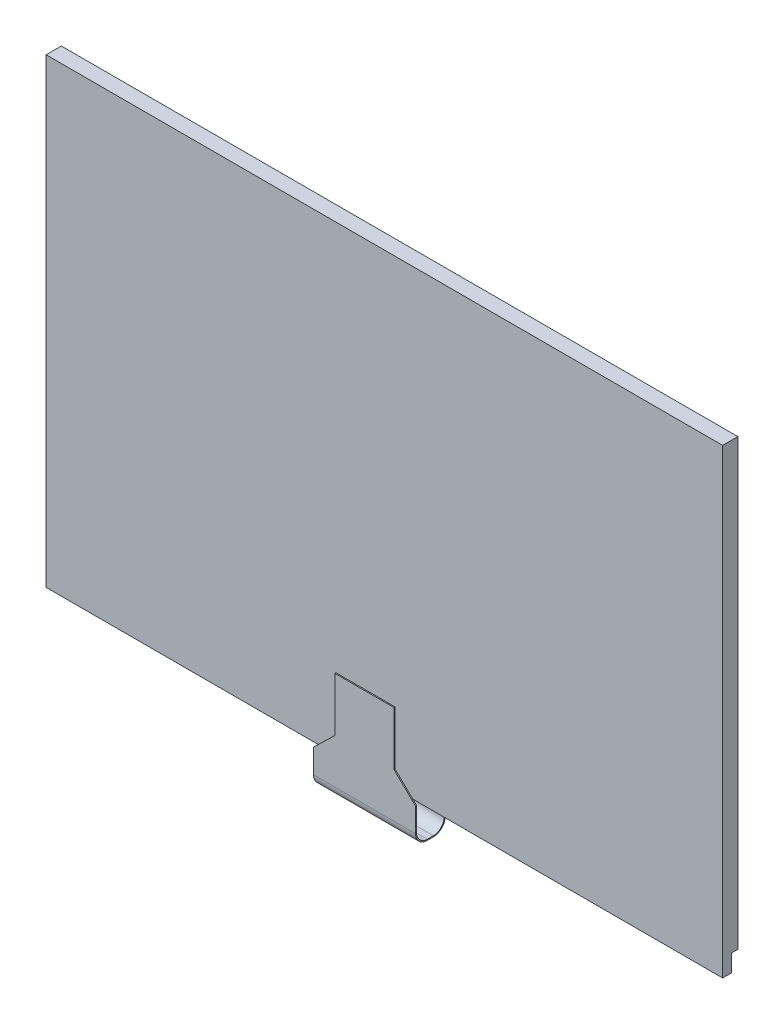
ISO-10303-21;
HEADER;
FILE_DESCRIPTION(('STEP AP214'),'2;1');
FILE_NAME('part.step','',(''),(''),'','','');
FILE_SCHEMA(('AUTOMOTIVE_DESIGN { 1 0 10303 214 1 1 1 1 }'));
ENDSEC;
DATA;
#1=APPLICATION_CONTEXT('core data for automotive mechanical design processes');
#2=APPLICATION_PROTOCOL_DEFINITION('international standard','automotive_design',2000,#1);
#3=PRODUCT_CONTEXT('',#1,'mechanical');
#4=PRODUCT('Part','Part','',(#3));
#5=PRODUCT_RELATED_PRODUCT_CATEGORY('part','',(#4));
#6=PRODUCT_DEFINITION_FORMATION('','',#4);
#7=PRODUCT_DEFINITION_CONTEXT('part definition',#1,'design');
#8=PRODUCT_DEFINITION('design','',#6,#7);
#9=PRODUCT_DEFINITION_SHAPE('','',#8);
#10=(LENGTH_UNIT() NAMED_UNIT(*) SI_UNIT(.MILLI.,.METRE.));
#11=(NAMED_UNIT(*) PLANE_ANGLE_UNIT() SI_UNIT($,.RADIAN.));
#12=(NAMED_UNIT(*) SI_UNIT($,.STERADIAN.) SOLID_ANGLE_UNIT());
#13=UNCERTAINTY_MEASURE_WITH_UNIT(LENGTH_MEASURE(1.E-05),#10,'distance_accuracy_value','');
#14=(GEOMETRIC_REPRESENTATION_CONTEXT(3) GLOBAL_UNCERTAINTY_ASSIGNED_CONTEXT((#13)) GLOBAL_UNIT_ASSIGNED_CONTEXT((#10,
#11,#12)) REPRESENTATION_CONTEXT('',''));
#15=CARTESIAN_POINT('',(0.,0.,0.));
#16=DIRECTION('',(0.,0.,1.));
#17=DIRECTION('',(1.,0.,0.));
#18=AXIS2_PLACEMENT_3D('',#15,#16,#17);
#19=CARTESIAN_POINT('',(31.4,22.31,-0.83));
#20=DIRECTION('',(0.,0.,1.));
#21=DIRECTION('',(0.,-1.,0.));
#22=AXIS2_PLACEMENT_3D('',#19,#20,#21);
#23=PLANE('',#22);
#24=DIRECTION('',(1.,0.,0.));
#25=VECTOR('',#24,1.);
#26=CARTESIAN_POINT('',(31.4,42.52,-0.83));
#27=LINE('',#26,#25);
#28=CARTESIAN_POINT('',(62.4,42.52,-0.83));
#29=VERTEX_POINT('',#28);
#30=CARTESIAN_POINT('',(0.400000000000001,42.52,-0.83));
#31=VERTEX_POINT('',#30);
#32=EDGE_CURVE('P0_E95',#29,#31,#27,.F.);
#33=ORIENTED_EDGE('',*,*,#32,.F.);
#34=DIRECTION('',(0.,1.,0.));
#35=VECTOR('',#34,1.);
#36=CARTESIAN_POINT('',(62.4,22.31,-0.83));
#37=LINE('',#36,#35);
#38=CARTESIAN_POINT('',(62.4,2.1,-0.83));
#39=VERTEX_POINT('',#38);
#40=EDGE_CURVE('P0_E92',#39,#29,#37,.T.);
#41=ORIENTED_EDGE('',*,*,#40,.F.);
#42=DIRECTION('',(1.,0.,0.));
#43=VECTOR('',#42,1.);
#44=CARTESIAN_POINT('',(31.4,2.1,-0.83));
#45=LINE('',#44,#43);
#46=CARTESIAN_POINT('',(0.400000000000001,2.1,-0.83));
#47=VERTEX_POINT('',#46);
#48=EDGE_CURVE('P0_E110',#47,#39,#45,.T.);
#49=ORIENTED_EDGE('',*,*,#48,.F.);
#50=DIRECTION('',(0.,1.,0.));
#51=VECTOR('',#50,1.);
#52=CARTESIAN_POINT('',(0.4,22.31,-0.83));
#53=LINE('',#52,#51);
#54=EDGE_CURVE('P0_E98',#31,#47,#53,.F.);
#55=ORIENTED_EDGE('',*,*,#54,.F.);
#56=EDGE_LOOP('',(#33,#41,#49,#55));
#57=FACE_BOUND('',#56,.T.);
#58=ADVANCED_FACE('P0_F17',(#57),#23,.F.);
#59=CARTESIAN_POINT('',(31.4,1.6,0.));
#60=DIRECTION('',(0.,-1.,0.));
#61=DIRECTION('',(0.,0.,-1.));
#62=AXIS2_PLACEMENT_3D('',#59,#60,#61);
#63=PLANE('',#62);
#64=DIRECTION('',(1.,0.,0.));
#65=VECTOR('',#64,1.);
#66=CARTESIAN_POINT('',(31.4,1.6,0.));
#67=LINE('',#66,#65);
#68=CARTESIAN_POINT('',(62.8,1.6,0.));
#69=VERTEX_POINT('',#68);
#70=CARTESIAN_POINT('',(0.,1.6,0.));
#71=VERTEX_POINT('',#70);
#72=EDGE_CURVE('P0_E125',#69,#71,#67,.F.);
#73=ORIENTED_EDGE('',*,*,#72,.T.);
#74=DIRECTION('',(0.,0.,-1.));
#75=VECTOR('',#74,1.);
#76=CARTESIAN_POINT('',(0.,1.6,0.));
#77=LINE('',#76,#75);
#78=CARTESIAN_POINT('',(0.,1.6,-0.6));
#79=VERTEX_POINT('',#78);
#80=EDGE_CURVE('P0_E101',#71,#79,#77,.T.);
#81=ORIENTED_EDGE('',*,*,#80,.T.);
#82=DIRECTION('',(1.,0.,0.));
#83=VECTOR('',#82,1.);
#84=CARTESIAN_POINT('',(31.4,1.6,-0.6));
#85=LINE('',#84,#83);
#86=CARTESIAN_POINT('',(62.8,1.6,-0.6));
#87=VERTEX_POINT('',#86);
#88=EDGE_CURVE('P0_E127',#79,#87,#85,.T.);
#89=ORIENTED_EDGE('',*,*,#88,.T.);
#90=DIRECTION('',(0.,0.,-1.));
#91=VECTOR('',#90,1.);
#92=CARTESIAN_POINT('',(62.8,1.6,0.));
#93=LINE('',#92,#91);
#94=EDGE_CURVE('P0_E20',#87,#69,#93,.F.);
#95=ORIENTED_EDGE('',*,*,#94,.T.);
#96=EDGE_LOOP('',(#73,#81,#89,#95));
#97=FACE_BOUND('',#96,.T.);
#98=ADVANCED_FACE('P0_F124',(#97),#63,.T.);
#99=CARTESIAN_POINT('',(31.4,42.52,-0.6));
#100=DIRECTION('',(0.,1.,0.));
#101=DIRECTION('',(0.,0.,1.));
#102=AXIS2_PLACEMENT_3D('',#99,#100,#101);
#103=PLANE('',#102);
#104=DIRECTION('',(1.,0.,0.));
#105=VECTOR('',#104,1.);
#106=CARTESIAN_POINT('',(31.4,42.52,-0.6));
#107=LINE('',#106,#105);
#108=CARTESIAN_POINT('',(0.400000000000001,42.52,-0.6));
#109=VERTEX_POINT('',#108);
#110=CARTESIAN_POINT('',(62.4,42.52,-0.6));
#111=VERTEX_POINT('',#110);
#112=EDGE_CURVE('P0_E107',#109,#111,#107,.T.);
#113=ORIENTED_EDGE('',*,*,#112,.T.);
#114=DIRECTION('',(0.,0.,-1.));
#115=VECTOR('',#114,1.);
#116=CARTESIAN_POINT('',(62.4,42.52,-0.6));
#117=LINE('',#116,#115);
#118=EDGE_CURVE('P0_E104',#29,#111,#117,.F.);
#119=ORIENTED_EDGE('',*,*,#118,.F.);
#120=ORIENTED_EDGE('',*,*,#32,.T.);
#121=DIRECTION('',(0.,0.,1.));
#122=VECTOR('',#121,1.);
#123=CARTESIAN_POINT('',(0.4,42.52,-0.6));
#124=LINE('',#123,#122);
#125=EDGE_CURVE('P0_E138',#109,#31,#124,.F.);
#126=ORIENTED_EDGE('',*,*,#125,.F.);
#127=EDGE_LOOP('',(#113,#119,#120,#126));
#128=FACE_BOUND('',#127,.T.);
#129=ADVANCED_FACE('P0_F105',(#128),#103,.T.);
#130=CARTESIAN_POINT('',(62.4,22.31,-0.6));
#131=DIRECTION('',(1.,0.,0.));
#132=DIRECTION('',(0.,0.,-1.));
#133=AXIS2_PLACEMENT_3D('',#130,#131,#132);
#134=PLANE('',#133);
#135=DIRECTION('',(0.,1.,0.));
#136=VECTOR('',#135,1.);
#137=CARTESIAN_POINT('',(62.4,22.21,-0.6));
#138=LINE('',#137,#136);
#139=CARTESIAN_POINT('',(62.4,2.1,-0.6));
#140=VERTEX_POINT('',#139);
#141=EDGE_CURVE('P0_E162',#111,#140,#138,.F.);
#142=ORIENTED_EDGE('',*,*,#141,.T.);
#143=DIRECTION('',(0.,0.,-1.));
#144=VECTOR('',#143,1.);
#145=CARTESIAN_POINT('',(62.4,2.1,-0.6));
#146=LINE('',#145,#144);
#147=EDGE_CURVE('P0_E114',#39,#140,#146,.F.);
#148=ORIENTED_EDGE('',*,*,#147,.F.);
#149=ORIENTED_EDGE('',*,*,#40,.T.);
#150=ORIENTED_EDGE('',*,*,#118,.T.);
#151=EDGE_LOOP('',(#142,#148,#149,#150));
#152=FACE_BOUND('',#151,.T.);
#153=ADVANCED_FACE('P0_F112',(#152),#134,.T.);
#154=CARTESIAN_POINT('',(31.4,2.1,-0.6));
#155=DIRECTION('',(0.,-1.,0.));
#156=DIRECTION('',(0.,0.,-1.));
#157=AXIS2_PLACEMENT_3D('',#154,#155,#156);
#158=PLANE('',#157);
#159=DIRECTION('',(1.,0.,0.));
#160=VECTOR('',#159,1.);
#161=CARTESIAN_POINT('',(31.4,2.1,-0.6));
#162=LINE('',#161,#160);
#163=CARTESIAN_POINT('',(0.400000000000001,2.1,-0.6));
#164=VERTEX_POINT('',#163);
#165=EDGE_CURVE('P0_E151',#140,#164,#162,.F.);
#166=ORIENTED_EDGE('',*,*,#165,.T.);
#167=DIRECTION('',(0.,0.,1.));
#168=VECTOR('',#167,1.);
#169=CARTESIAN_POINT('',(0.4,2.1,-0.6));
#170=LINE('',#169,#168);
#171=EDGE_CURVE('P0_E143',#47,#164,#170,.T.);
#172=ORIENTED_EDGE('',*,*,#171,.F.);
#173=ORIENTED_EDGE('',*,*,#48,.T.);
#174=ORIENTED_EDGE('',*,*,#147,.T.);
#175=EDGE_LOOP('',(#166,#172,#173,#174));
#176=FACE_BOUND('',#175,.T.);
#177=ADVANCED_FACE('P0_F149',(#176),#158,.T.);
#178=CARTESIAN_POINT('',(0.4,22.31,-0.6));
#179=DIRECTION('',(-1.,0.,0.));
#180=DIRECTION('',(0.,0.,1.));
#181=AXIS2_PLACEMENT_3D('',#178,#179,#180);
#182=PLANE('',#181);
#183=DIRECTION('',(0.,1.,0.));
#184=VECTOR('',#183,1.);
#185=CARTESIAN_POINT('',(0.400000000000001,22.21,-0.6));
#186=LINE('',#185,#184);
#187=EDGE_CURVE('P0_E156',#164,#109,#186,.T.);
#188=ORIENTED_EDGE('',*,*,#187,.T.);
#189=ORIENTED_EDGE('',*,*,#125,.T.);
#190=ORIENTED_EDGE('',*,*,#54,.T.);
#191=ORIENTED_EDGE('',*,*,#171,.T.);
#192=EDGE_LOOP('',(#188,#189,#190,#191));
#193=FACE_BOUND('',#192,.T.);
#194=ADVANCED_FACE('P0_F155',(#193),#182,.T.);
#195=CARTESIAN_POINT('',(31.4,21.41,0.));
#196=DIRECTION('',(0.,0.,1.));
#197=DIRECTION('',(1.,0.,0.));
#198=AXIS2_PLACEMENT_3D('',#195,#196,#197);
#199=PLANE('',#198);
#200=DIRECTION('',(0.,1.,0.));
#201=VECTOR('',#200,1.);
#202=CARTESIAN_POINT('',(62.8,21.41,0.));
#203=LINE('',#202,#201);
#204=CARTESIAN_POINT('',(62.8,0.,0.));
#205=VERTEX_POINT('',#204);
#206=EDGE_CURVE('P0_E134',#205,#69,#203,.T.);
#207=ORIENTED_EDGE('',*,*,#206,.F.);
#208=DIRECTION('',(1.,0.,0.));
#209=VECTOR('',#208,1.);
#210=CARTESIAN_POINT('',(31.4,0.,0.));
#211=LINE('',#210,#209);
#212=CARTESIAN_POINT('',(0.,0.,0.));
#213=VERTEX_POINT('',#212);
#214=EDGE_CURVE('P0_E177',#213,#205,#211,.T.);
#215=ORIENTED_EDGE('',*,*,#214,.F.);
#216=DIRECTION('',(0.,-1.,0.));
#217=VECTOR('',#216,1.);
#218=CARTESIAN_POINT('',(0.,21.41,0.));
#219=LINE('',#218,#217);
#220=EDGE_CURVE('P0_E135',#71,#213,#219,.T.);
#221=ORIENTED_EDGE('',*,*,#220,.F.);
#222=ORIENTED_EDGE('',*,*,#72,.F.);
#223=EDGE_LOOP('',(#207,#215,#221,#222));
#224=FACE_BOUND('',#223,.T.);
#225=ADVANCED_FACE('P0_F132',(#224),#199,.F.);
#226=CARTESIAN_POINT('',(31.4,22.21,-0.6));
#227=DIRECTION('',(0.,0.,1.));
#228=DIRECTION('',(1.,0.,0.));
#229=AXIS2_PLACEMENT_3D('',#226,#227,#228);
#230=PLANE('',#229);
#231=ORIENTED_EDGE('',*,*,#165,.F.);
#232=ORIENTED_EDGE('',*,*,#141,.F.);
#233=ORIENTED_EDGE('',*,*,#112,.F.);
#234=ORIENTED_EDGE('',*,*,#187,.F.);
#235=EDGE_LOOP('',(#231,#232,#233,#234));
#236=FACE_BOUND('',#235,.T.);
#237=DIRECTION('',(0.,-1.,0.));
#238=VECTOR('',#237,1.);
#239=CARTESIAN_POINT('',(0.,21.41,-0.6));
#240=LINE('',#239,#238);
#241=CARTESIAN_POINT('',(0.,42.82,-0.6));
#242=VERTEX_POINT('',#241);
#243=EDGE_CURVE('P0_E170',#242,#79,#240,.T.);
#244=ORIENTED_EDGE('',*,*,#243,.F.);
#245=DIRECTION('',(1.,0.,0.));
#246=VECTOR('',#245,1.);
#247=CARTESIAN_POINT('',(31.4,42.82,-0.6));
#248=LINE('',#247,#246);
#249=CARTESIAN_POINT('',(62.8,42.82,-0.6));
#250=VERTEX_POINT('',#249);
#251=EDGE_CURVE('P0_E158',#250,#242,#248,.F.);
#252=ORIENTED_EDGE('',*,*,#251,.F.);
#253=DIRECTION('',(0.,1.,0.));
#254=VECTOR('',#253,1.);
#255=CARTESIAN_POINT('',(62.8,21.41,-0.6));
#256=LINE('',#255,#254);
#257=EDGE_CURVE('P0_E180',#87,#250,#256,.T.);
#258=ORIENTED_EDGE('',*,*,#257,.F.);
#259=ORIENTED_EDGE('',*,*,#88,.F.);
#260=EDGE_LOOP('',(#244,#252,#258,#259));
#261=FACE_BOUND('',#260,.T.);
#262=ADVANCED_FACE('P0_F160',(#236,#261),#230,.F.);
#263=CARTESIAN_POINT('',(31.4,42.82,0.));
#264=DIRECTION('',(0.,1.,0.));
#265=DIRECTION('',(0.,0.,1.));
#266=AXIS2_PLACEMENT_3D('',#263,#264,#265);
#267=PLANE('',#266);
#268=ORIENTED_EDGE('',*,*,#251,.T.);
#269=DIRECTION('',(0.,0.,1.));
#270=VECTOR('',#269,1.);
#271=CARTESIAN_POINT('',(0.,42.82,0.));
#272=LINE('',#271,#270);
#273=CARTESIAN_POINT('',(0.,42.82,0.81));
#274=VERTEX_POINT('',#273);
#275=EDGE_CURVE('P0_E167',#274,#242,#272,.F.);
#276=ORIENTED_EDGE('',*,*,#275,.F.);
#277=DIRECTION('',(1.,0.,0.));
#278=VECTOR('',#277,1.);
#279=CARTESIAN_POINT('',(31.4,42.82,0.81));
#280=LINE('',#279,#278);
#281=CARTESIAN_POINT('',(62.8,42.82,0.81));
#282=VERTEX_POINT('',#281);
#283=EDGE_CURVE('P0_E185',#282,#274,#280,.F.);
#284=ORIENTED_EDGE('',*,*,#283,.F.);
#285=DIRECTION('',(0.,0.,-1.));
#286=VECTOR('',#285,1.);
#287=CARTESIAN_POINT('',(62.8,42.82,0.));
#288=LINE('',#287,#286);
#289=EDGE_CURVE('P0_E182',#250,#282,#288,.F.);
#290=ORIENTED_EDGE('',*,*,#289,.F.);
#291=EDGE_LOOP('',(#268,#276,#284,#290));
#292=FACE_BOUND('',#291,.T.);
#293=ADVANCED_FACE('P0_F202',(#292),#267,.T.);
#294=CARTESIAN_POINT('',(0.,21.41,0.));
#295=DIRECTION('',(-1.,0.,0.));
#296=DIRECTION('',(0.,-1.,0.));
#297=AXIS2_PLACEMENT_3D('',#294,#295,#296);
#298=PLANE('',#297);
#299=ORIENTED_EDGE('',*,*,#220,.T.);
#300=DIRECTION('',(0.,0.,-1.));
#301=VECTOR('',#300,1.);
#302=CARTESIAN_POINT('',(0.,0.,0.));
#303=LINE('',#302,#301);
#304=CARTESIAN_POINT('',(0.,0.,0.81));
#305=VERTEX_POINT('',#304);
#306=EDGE_CURVE('P0_E174',#305,#213,#303,.T.);
#307=ORIENTED_EDGE('',*,*,#306,.F.);
#308=DIRECTION('',(0.,1.,0.));
#309=VECTOR('',#308,1.);
#310=CARTESIAN_POINT('',(0.,21.41,0.81));
#311=LINE('',#310,#309);
#312=EDGE_CURVE('P0_E188',#274,#305,#311,.F.);
#313=ORIENTED_EDGE('',*,*,#312,.F.);
#314=ORIENTED_EDGE('',*,*,#275,.T.);
#315=ORIENTED_EDGE('',*,*,#243,.T.);
#316=ORIENTED_EDGE('',*,*,#80,.F.);
#317=EDGE_LOOP('',(#299,#307,#313,#314,#315,#316));
#318=FACE_BOUND('',#317,.T.);
#319=ADVANCED_FACE('P0_F197',(#318),#298,.T.);
#320=CARTESIAN_POINT('',(31.4,0.,0.));
#321=DIRECTION('',(0.,-1.,0.));
#322=DIRECTION('',(0.,0.,-1.));
#323=AXIS2_PLACEMENT_3D('',#320,#321,#322);
#324=PLANE('',#323);
#325=ORIENTED_EDGE('',*,*,#214,.T.);
#326=DIRECTION('',(0.,0.,-1.));
#327=VECTOR('',#326,1.);
#328=CARTESIAN_POINT('',(62.8,0.,0.));
#329=LINE('',#328,#327);
#330=CARTESIAN_POINT('',(62.8,0.,0.81));
#331=VERTEX_POINT('',#330);
#332=EDGE_CURVE('P0_E35',#331,#205,#329,.T.);
#333=ORIENTED_EDGE('',*,*,#332,.F.);
#334=DIRECTION('',(1.,0.,0.));
#335=VECTOR('',#334,1.);
#336=CARTESIAN_POINT('',(31.4,0.,0.81));
#337=LINE('',#336,#335);
#338=EDGE_CURVE('P0_E26',#305,#331,#337,.T.);
#339=ORIENTED_EDGE('',*,*,#338,.F.);
#340=ORIENTED_EDGE('',*,*,#306,.T.);
#341=EDGE_LOOP('',(#325,#333,#339,#340));
#342=FACE_BOUND('',#341,.T.);
#343=ADVANCED_FACE('P0_F195',(#342),#324,.T.);
#344=CARTESIAN_POINT('',(62.8,21.41,0.));
#345=DIRECTION('',(1.,0.,0.));
#346=DIRECTION('',(0.,0.,-1.));
#347=AXIS2_PLACEMENT_3D('',#344,#345,#346);
#348=PLANE('',#347);
#349=ORIENTED_EDGE('',*,*,#257,.T.);
#350=ORIENTED_EDGE('',*,*,#289,.T.);
#351=DIRECTION('',(0.,1.,0.));
#352=VECTOR('',#351,1.);
#353=CARTESIAN_POINT('',(62.8,21.41,0.81));
#354=LINE('',#353,#352);
#355=EDGE_CURVE('P0_E11',#331,#282,#354,.T.);
#356=ORIENTED_EDGE('',*,*,#355,.F.);
#357=ORIENTED_EDGE('',*,*,#332,.T.);
#358=ORIENTED_EDGE('',*,*,#206,.T.);
#359=ORIENTED_EDGE('',*,*,#94,.F.);
#360=EDGE_LOOP('',(#349,#350,#356,#357,#358,#359));
#361=FACE_BOUND('',#360,.T.);
#362=ADVANCED_FACE('P0_F200',(#361),#348,.T.);
#363=CARTESIAN_POINT('',(31.4,21.41,0.81));
#364=DIRECTION('',(0.,0.,1.));
#365=DIRECTION('',(1.,0.,0.));
#366=AXIS2_PLACEMENT_3D('',#363,#364,#365);
#367=PLANE('',#366);
#368=ORIENTED_EDGE('',*,*,#338,.T.);
#369=ORIENTED_EDGE('',*,*,#355,.T.);
#370=ORIENTED_EDGE('',*,*,#283,.T.);
#371=ORIENTED_EDGE('',*,*,#312,.T.);
#372=EDGE_LOOP('',(#368,#369,#370,#371));
#373=FACE_BOUND('',#372,.T.);
#374=ADVANCED_FACE('P0_F193',(#373),#367,.T.);
#375=CLOSED_SHELL('',(#58,#98,#129,#153,#177,#194,#225,#262,#293,#319,#343,#362,#374));
#376=MANIFOLD_SOLID_BREP('P0_B1',#375);
#377=CARTESIAN_POINT('',(31.4,23.18,-0.835));
#378=DIRECTION('',(0.,0.,1.));
#379=DIRECTION('',(1.,0.,0.));
#380=AXIS2_PLACEMENT_3D('',#377,#378,#379);
#381=PLANE('',#380);
#382=DIRECTION('',(-1.,0.,0.));
#383=VECTOR('',#382,1.);
#384=CARTESIAN_POINT('',(31.4,40.82,-0.835));
#385=LINE('',#384,#383);
#386=CARTESIAN_POINT('',(60.8,40.82,-0.835));
#387=VERTEX_POINT('',#386);
#388=CARTESIAN_POINT('',(2.,40.82,-0.835));
#389=VERTEX_POINT('',#388);
#390=EDGE_CURVE('P1_E20',#387,#389,#385,.T.);
#391=ORIENTED_EDGE('',*,*,#390,.F.);
#392=DIRECTION('',(0.,1.,0.));
#393=VECTOR('',#392,1.);
#394=CARTESIAN_POINT('',(60.8,23.18,-0.835));
#395=LINE('',#394,#393);
#396=CARTESIAN_POINT('',(60.8,5.54,-0.835));
#397=VERTEX_POINT('',#396);
#398=EDGE_CURVE('P1_E80',#397,#387,#395,.T.);
#399=ORIENTED_EDGE('',*,*,#398,.F.);
#400=DIRECTION('',(1.,0.,0.));
#401=VECTOR('',#400,1.);
#402=CARTESIAN_POINT('',(31.4,5.54,-0.835));
#403=LINE('',#402,#401);
#404=CARTESIAN_POINT('',(2.,5.54,-0.835));
#405=VERTEX_POINT('',#404);
#406=EDGE_CURVE('P1_E68',#405,#397,#403,.T.);
#407=ORIENTED_EDGE('',*,*,#406,.F.);
#408=DIRECTION('',(0.,-1.,0.));
#409=VECTOR('',#408,1.);
#410=CARTESIAN_POINT('',(2.,23.18,-0.835));
#411=LINE('',#410,#409);
#412=EDGE_CURVE('P1_E55',#389,#405,#411,.T.);
#413=ORIENTED_EDGE('',*,*,#412,.F.);
#414=EDGE_LOOP('',(#391,#399,#407,#413));
#415=FACE_BOUND('',#414,.T.);
#416=ADVANCED_FACE('P1_F17',(#415),#381,.F.);
#417=CARTESIAN_POINT('',(31.4,40.82,-0.835));
#418=DIRECTION('',(0.,1.,0.));
#419=DIRECTION('',(-1.,0.,0.));
#420=AXIS2_PLACEMENT_3D('',#417,#418,#419);
#421=PLANE('',#420);
#422=ORIENTED_EDGE('',*,*,#390,.T.);
#423=DIRECTION('',(0.,0.,1.));
#424=VECTOR('',#423,1.);
#425=CARTESIAN_POINT('',(2.,40.82,-0.835));
#426=LINE('',#425,#424);
#427=CARTESIAN_POINT('',(2.,40.82,-0.83));
#428=VERTEX_POINT('',#427);
#429=EDGE_CURVE('P1_E61',#428,#389,#426,.F.);
#430=ORIENTED_EDGE('',*,*,#429,.F.);
#431=DIRECTION('',(1.,0.,0.));
#432=VECTOR('',#431,1.);
#433=CARTESIAN_POINT('',(31.4,40.82,-0.83));
#434=LINE('',#433,#432);
#435=CARTESIAN_POINT('',(60.8,40.82,-0.83));
#436=VERTEX_POINT('',#435);
#437=EDGE_CURVE('P1_E83',#436,#428,#434,.F.);
#438=ORIENTED_EDGE('',*,*,#437,.F.);
#439=DIRECTION('',(0.,0.,-1.));
#440=VECTOR('',#439,1.);
#441=CARTESIAN_POINT('',(60.8,40.82,-0.835));
#442=LINE('',#441,#440);
#443=EDGE_CURVE('P1_E64',#387,#436,#442,.F.);
#444=ORIENTED_EDGE('',*,*,#443,.F.);
#445=EDGE_LOOP('',(#422,#430,#438,#444));
#446=FACE_BOUND('',#445,.T.);
#447=ADVANCED_FACE('P1_F60',(#446),#421,.T.);
#448=CARTESIAN_POINT('',(2.,23.18,-0.835));
#449=DIRECTION('',(-1.,0.,0.));
#450=DIRECTION('',(0.,-1.,0.));
#451=AXIS2_PLACEMENT_3D('',#448,#449,#450);
#452=PLANE('',#451);
#453=ORIENTED_EDGE('',*,*,#412,.T.);
#454=DIRECTION('',(0.,0.,-1.));
#455=VECTOR('',#454,1.);
#456=CARTESIAN_POINT('',(2.,5.54,-0.835));
#457=LINE('',#456,#455);
#458=CARTESIAN_POINT('',(2.,5.54,-0.83));
#459=VERTEX_POINT('',#458);
#460=EDGE_CURVE('P1_E70',#459,#405,#457,.T.);
#461=ORIENTED_EDGE('',*,*,#460,.F.);
#462=DIRECTION('',(0.,1.,0.));
#463=VECTOR('',#462,1.);
#464=CARTESIAN_POINT('',(2.,23.18,-0.83));
#465=LINE('',#464,#463);
#466=EDGE_CURVE('P1_E74',#428,#459,#465,.F.);
#467=ORIENTED_EDGE('',*,*,#466,.F.);
#468=ORIENTED_EDGE('',*,*,#429,.T.);
#469=EDGE_LOOP('',(#453,#461,#467,#468));
#470=FACE_BOUND('',#469,.T.);
#471=ADVANCED_FACE('P1_F72',(#470),#452,.T.);
#472=CARTESIAN_POINT('',(31.4,5.54,-0.835));
#473=DIRECTION('',(0.,-1.,0.));
#474=DIRECTION('',(0.,0.,-1.));
#475=AXIS2_PLACEMENT_3D('',#472,#473,#474);
#476=PLANE('',#475);
#477=ORIENTED_EDGE('',*,*,#406,.T.);
#478=DIRECTION('',(0.,0.,-1.));
#479=VECTOR('',#478,1.);
#480=CARTESIAN_POINT('',(60.8,5.54,-0.835));
#481=LINE('',#480,#479);
#482=CARTESIAN_POINT('',(60.8,5.54,-0.83));
#483=VERTEX_POINT('',#482);
#484=EDGE_CURVE('P1_E35',#483,#397,#481,.T.);
#485=ORIENTED_EDGE('',*,*,#484,.F.);
#486=DIRECTION('',(1.,0.,0.));
#487=VECTOR('',#486,1.);
#488=CARTESIAN_POINT('',(31.4,5.54,-0.83));
#489=LINE('',#488,#487);
#490=EDGE_CURVE('P1_E26',#459,#483,#489,.T.);
#491=ORIENTED_EDGE('',*,*,#490,.F.);
#492=ORIENTED_EDGE('',*,*,#460,.T.);
#493=EDGE_LOOP('',(#477,#485,#491,#492));
#494=FACE_BOUND('',#493,.T.);
#495=ADVANCED_FACE('P1_F89',(#494),#476,.T.);
#496=CARTESIAN_POINT('',(60.8,23.18,-0.835));
#497=DIRECTION('',(1.,0.,0.));
#498=DIRECTION('',(0.,0.,-1.));
#499=AXIS2_PLACEMENT_3D('',#496,#497,#498);
#500=PLANE('',#499);
#501=ORIENTED_EDGE('',*,*,#398,.T.);
#502=ORIENTED_EDGE('',*,*,#443,.T.);
#503=DIRECTION('',(0.,1.,0.));
#504=VECTOR('',#503,1.);
#505=CARTESIAN_POINT('',(60.8,23.18,-0.83));
#506=LINE('',#505,#504);
#507=EDGE_CURVE('P1_E11',#483,#436,#506,.T.);
#508=ORIENTED_EDGE('',*,*,#507,.F.);
#509=ORIENTED_EDGE('',*,*,#484,.T.);
#510=EDGE_LOOP('',(#501,#502,#508,#509));
#511=FACE_BOUND('',#510,.T.);
#512=ADVANCED_FACE('P1_F91',(#511),#500,.T.);
#513=CARTESIAN_POINT('',(31.4,23.18,-0.83));
#514=DIRECTION('',(0.,0.,1.));
#515=DIRECTION('',(1.,0.,0.));
#516=AXIS2_PLACEMENT_3D('',#513,#514,#515);
#517=PLANE('',#516);
#518=ORIENTED_EDGE('',*,*,#490,.T.);
#519=ORIENTED_EDGE('',*,*,#507,.T.);
#520=ORIENTED_EDGE('',*,*,#437,.T.);
#521=ORIENTED_EDGE('',*,*,#466,.T.);
#522=EDGE_LOOP('',(#518,#519,#520,#521));
#523=FACE_BOUND('',#522,.T.);
#524=ADVANCED_FACE('P1_F88',(#523),#517,.T.);
#525=CLOSED_SHELL('',(#416,#447,#471,#495,#512,#524));
#526=MANIFOLD_SOLID_BREP('P1_B1',#525);
#527=CARTESIAN_POINT('',(31.4,-6.089518552174,-0.1));
#528=DIRECTION('',(0.,0.,-1.));
#529=DIRECTION('',(-1.,0.,0.));
#530=AXIS2_PLACEMENT_3D('',#527,#528,#529);
#531=PLANE('',#530);
#532=DIRECTION('',(1.,0.,0.));
#533=VECTOR('',#532,1.);
#534=CARTESIAN_POINT('',(26.665,1.,-0.1));
#535=LINE('',#534,#533);
#536=CARTESIAN_POINT('',(36.135,1.,-0.1));
#537=VERTEX_POINT('',#536);
#538=CARTESIAN_POINT('',(26.665,1.,-0.1));
#539=VERTEX_POINT('',#538);
#540=EDGE_CURVE('P2_E151',#537,#539,#535,.F.);
#541=ORIENTED_EDGE('',*,*,#540,.F.);
#542=DIRECTION('',(0.,1.,0.));
#543=VECTOR('',#542,1.);
#544=CARTESIAN_POINT('',(36.135,1.,-0.1));
#545=LINE('',#544,#543);
#546=CARTESIAN_POINT('',(36.135,-0.8,-0.1));
#547=VERTEX_POINT('',#546);
#548=EDGE_CURVE('P2_E154',#547,#537,#545,.T.);
#549=ORIENTED_EDGE('',*,*,#548,.F.);
#550=DIRECTION('',(-1.,0.,0.));
#551=VECTOR('',#550,1.);
#552=CARTESIAN_POINT('',(31.4,-0.8,-0.1));
#553=LINE('',#552,#551);
#554=CARTESIAN_POINT('',(26.665,-0.8,-0.1));
#555=VERTEX_POINT('',#554);
#556=EDGE_CURVE('P2_E160',#555,#547,#553,.F.);
#557=ORIENTED_EDGE('',*,*,#556,.F.);
#558=DIRECTION('',(0.,1.,0.));
#559=VECTOR('',#558,1.);
#560=CARTESIAN_POINT('',(26.665,-6.86,-0.1));
#561=LINE('',#560,#559);
#562=EDGE_CURVE('P2_E161',#539,#555,#561,.F.);
#563=ORIENTED_EDGE('',*,*,#562,.F.);
#564=EDGE_LOOP('',(#541,#549,#557,#563));
#565=FACE_BOUND('',#564,.T.);
#566=ADVANCED_FACE('P2_F17',(#565),#531,.T.);
#567=CARTESIAN_POINT('',(26.665,1.,0.));
#568=DIRECTION('',(0.,1.,0.));
#569=DIRECTION('',(0.,0.,1.));
#570=AXIS2_PLACEMENT_3D('',#567,#568,#569);
#571=PLANE('',#570);
#572=ORIENTED_EDGE('',*,*,#540,.T.);
#573=DIRECTION('',(0.,0.,1.));
#574=VECTOR('',#573,1.);
#575=CARTESIAN_POINT('',(26.665,1.,0.));
#576=LINE('',#575,#574);
#577=CARTESIAN_POINT('',(26.665,1.,0.));
#578=VERTEX_POINT('',#577);
#579=EDGE_CURVE('P2_E183',#578,#539,#576,.F.);
#580=ORIENTED_EDGE('',*,*,#579,.F.);
#581=DIRECTION('',(-1.,0.,0.));
#582=VECTOR('',#581,1.);
#583=CARTESIAN_POINT('',(31.4,1.,0.));
#584=LINE('',#583,#582);
#585=CARTESIAN_POINT('',(36.135,1.,0.));
#586=VERTEX_POINT('',#585);
#587=EDGE_CURVE('P2_E164',#578,#586,#584,.F.);
#588=ORIENTED_EDGE('',*,*,#587,.T.);
#589=DIRECTION('',(0.,0.,-1.));
#590=VECTOR('',#589,1.);
#591=CARTESIAN_POINT('',(36.135,1.,0.));
#592=LINE('',#591,#590);
#593=EDGE_CURVE('P2_E181',#537,#586,#592,.F.);
#594=ORIENTED_EDGE('',*,*,#593,.F.);
#595=EDGE_LOOP('',(#572,#580,#588,#594));
#596=FACE_BOUND('',#595,.T.);
#597=ADVANCED_FACE('P2_F433',(#596),#571,.T.);
#598=CARTESIAN_POINT('',(31.4,-0.8,1.));
#599=DIRECTION('',(-1.,0.,0.));
#600=DIRECTION('',(0.,0.,1.));
#601=AXIS2_PLACEMENT_3D('',#598,#599,#600);
#602=CYLINDRICAL_SURFACE('',#601,1.1);
#603=ORIENTED_EDGE('',*,*,#556,.T.);
#604=CARTESIAN_POINT('',(36.135,-0.8,1.));
#605=DIRECTION('',(-1.,0.,0.));
#606=DIRECTION('',(0.,0.,1.));
#607=AXIS2_PLACEMENT_3D('',#604,#605,#606);
#608=CIRCLE('',#607,1.1);
#609=CARTESIAN_POINT('',(36.135,-1.9,1.));
#610=VERTEX_POINT('',#609);
#611=EDGE_CURVE('P2_E162',#547,#610,#608,.T.);
#612=ORIENTED_EDGE('',*,*,#611,.T.);
#613=DIRECTION('',(1.,0.,0.));
#614=VECTOR('',#613,1.);
#615=CARTESIAN_POINT('',(31.4,-1.9,1.));
#616=LINE('',#615,#614);
#617=CARTESIAN_POINT('',(26.665,-1.9,1.));
#618=VERTEX_POINT('',#617);
#619=EDGE_CURVE('P2_E166',#618,#610,#616,.T.);
#620=ORIENTED_EDGE('',*,*,#619,.F.);
#621=CARTESIAN_POINT('',(26.665,-0.8,1.));
#622=DIRECTION('',(-1.,0.,0.));
#623=DIRECTION('',(0.,0.,1.));
#624=AXIS2_PLACEMENT_3D('',#621,#622,#623);
#625=CIRCLE('',#624,1.1);
#626=EDGE_CURVE('P2_E157',#618,#555,#625,.F.);
#627=ORIENTED_EDGE('',*,*,#626,.T.);
#628=EDGE_LOOP('',(#603,#612,#620,#627));
#629=FACE_BOUND('',#628,.T.);
#630=ADVANCED_FACE('P2_F423',(#629),#602,.T.);
#631=CARTESIAN_POINT('',(31.4,-6.089518552174,0.));
#632=DIRECTION('',(0.,0.,-1.));
#633=DIRECTION('',(-1.,0.,0.));
#634=AXIS2_PLACEMENT_3D('',#631,#632,#633);
#635=PLANE('',#634);
#636=DIRECTION('',(-1.,0.,0.));
#637=VECTOR('',#636,1.);
#638=CARTESIAN_POINT('',(31.4,-0.8,0.));
#639=LINE('',#638,#637);
#640=CARTESIAN_POINT('',(26.665,-0.8,0.));
#641=VERTEX_POINT('',#640);
#642=CARTESIAN_POINT('',(36.135,-0.8,0.));
#643=VERTEX_POINT('',#642);
#644=EDGE_CURVE('P2_E149',#641,#643,#639,.F.);
#645=ORIENTED_EDGE('',*,*,#644,.T.);
#646=DIRECTION('',(0.,1.,0.));
#647=VECTOR('',#646,1.);
#648=CARTESIAN_POINT('',(36.135,-6.089518552174,0.));
#649=LINE('',#648,#647);
#650=EDGE_CURVE('P2_E177',#586,#643,#649,.F.);
#651=ORIENTED_EDGE('',*,*,#650,.F.);
#652=ORIENTED_EDGE('',*,*,#587,.F.);
#653=DIRECTION('',(0.,1.,0.));
#654=VECTOR('',#653,1.);
#655=CARTESIAN_POINT('',(26.665,-6.089518552174,0.));
#656=LINE('',#655,#654);
#657=EDGE_CURVE('P2_E167',#641,#578,#656,.T.);
#658=ORIENTED_EDGE('',*,*,#657,.F.);
#659=EDGE_LOOP('',(#645,#651,#652,#658));
#660=FACE_BOUND('',#659,.T.);
#661=ADVANCED_FACE('P2_F413',(#660),#635,.F.);
#662=CARTESIAN_POINT('',(31.4,-1.9,4.649607187));
#663=DIRECTION('',(0.,-1.,0.));
#664=DIRECTION('',(0.,0.,-1.));
#665=AXIS2_PLACEMENT_3D('',#662,#663,#664);
#666=PLANE('',#665);
#667=DIRECTION('',(-1.,0.,0.));
#668=VECTOR('',#667,1.);
#669=CARTESIAN_POINT('',(31.4,-1.9,1.560088634826));
#670=LINE('',#669,#668);
#671=CARTESIAN_POINT('',(26.665,-1.9,1.560088634826));
#672=VERTEX_POINT('',#671);
#673=CARTESIAN_POINT('',(36.135,-1.9,1.560088634826));
#674=VERTEX_POINT('',#673);
#675=EDGE_CURVE('P2_E174',#672,#674,#670,.F.);
#676=ORIENTED_EDGE('',*,*,#675,.F.);
#677=DIRECTION('',(0.,0.,1.));
#678=VECTOR('',#677,1.);
#679=CARTESIAN_POINT('',(26.665,-1.9,5.420088634826));
#680=LINE('',#679,#678);
#681=EDGE_CURVE('P2_E170',#618,#672,#680,.T.);
#682=ORIENTED_EDGE('',*,*,#681,.F.);
#683=ORIENTED_EDGE('',*,*,#619,.T.);
#684=DIRECTION('',(0.,0.,-1.));
#685=VECTOR('',#684,1.);
#686=CARTESIAN_POINT('',(36.135,-1.9,-2.439911365174));
#687=LINE('',#686,#685);
#688=EDGE_CURVE('P2_E175',#674,#610,#687,.T.);
#689=ORIENTED_EDGE('',*,*,#688,.F.);
#690=EDGE_LOOP('',(#676,#682,#683,#689));
#691=FACE_BOUND('',#690,.T.);
#692=ADVANCED_FACE('P2_F404',(#691),#666,.T.);
#693=CARTESIAN_POINT('',(31.4,-0.8,1.));
#694=DIRECTION('',(-1.,0.,0.));
#695=DIRECTION('',(0.,0.,1.));
#696=AXIS2_PLACEMENT_3D('',#693,#694,#695);
#697=CYLINDRICAL_SURFACE('',#696,1.);
#698=DIRECTION('',(1.,0.,0.));
#699=VECTOR('',#698,1.);
#700=CARTESIAN_POINT('',(31.4,-1.8,1.));
#701=LINE('',#700,#699);
#702=CARTESIAN_POINT('',(26.665,-1.8,1.));
#703=VERTEX_POINT('',#702);
#704=CARTESIAN_POINT('',(36.135,-1.8,1.));
#705=VERTEX_POINT('',#704);
#706=EDGE_CURVE('P2_E136',#703,#705,#701,.T.);
#707=ORIENTED_EDGE('',*,*,#706,.T.);
#708=CARTESIAN_POINT('',(36.135,-0.8,1.));
#709=DIRECTION('',(-1.,0.,0.));
#710=DIRECTION('',(0.,0.,1.));
#711=AXIS2_PLACEMENT_3D('',#708,#709,#710);
#712=CIRCLE('',#711,1.);
#713=EDGE_CURVE('P2_E150',#643,#705,#712,.T.);
#714=ORIENTED_EDGE('',*,*,#713,.F.);
#715=ORIENTED_EDGE('',*,*,#644,.F.);
#716=CARTESIAN_POINT('',(26.665,-0.8,1.));
#717=DIRECTION('',(-1.,0.,0.));
#718=DIRECTION('',(0.,0.,1.));
#719=AXIS2_PLACEMENT_3D('',#716,#717,#718);
#720=CIRCLE('',#719,1.);
#721=EDGE_CURVE('P2_E20',#703,#641,#720,.F.);
#722=ORIENTED_EDGE('',*,*,#721,.F.);
#723=EDGE_LOOP('',(#707,#714,#715,#722));
#724=FACE_BOUND('',#723,.T.);
#725=ADVANCED_FACE('P2_F147',(#724),#697,.F.);
#726=CARTESIAN_POINT('',(31.4,-0.8,1.560088634826));
#727=DIRECTION('',(-1.,0.,0.));
#728=DIRECTION('',(0.,0.,1.));
#729=AXIS2_PLACEMENT_3D('',#726,#727,#728);
#730=CYLINDRICAL_SURFACE('',#729,1.1);
#731=ORIENTED_EDGE('',*,*,#675,.T.);
#732=CARTESIAN_POINT('',(36.135,-0.8,1.560088634826));
#733=DIRECTION('',(-1.,0.,0.));
#734=DIRECTION('',(0.,0.,1.));
#735=AXIS2_PLACEMENT_3D('',#732,#733,#734);
#736=CIRCLE('',#735,1.1);
#737=CARTESIAN_POINT('',(36.135,-0.8,2.660088634826));
#738=VERTEX_POINT('',#737);
#739=EDGE_CURVE('P2_E137',#674,#738,#736,.T.);
#740=ORIENTED_EDGE('',*,*,#739,.T.);
#741=DIRECTION('',(1.,0.,0.));
#742=VECTOR('',#741,1.);
#743=CARTESIAN_POINT('',(31.4,-0.8,2.660088634826));
#744=LINE('',#743,#742);
#745=CARTESIAN_POINT('',(26.665,-0.8,2.660088634826));
#746=VERTEX_POINT('',#745);
#747=EDGE_CURVE('P2_E216',#746,#738,#744,.T.);
#748=ORIENTED_EDGE('',*,*,#747,.F.);
#749=CARTESIAN_POINT('',(26.665,-0.8,1.560088634826));
#750=DIRECTION('',(-1.,0.,0.));
#751=DIRECTION('',(0.,0.,1.));
#752=AXIS2_PLACEMENT_3D('',#749,#750,#751);
#753=CIRCLE('',#752,1.1);
#754=EDGE_CURVE('P2_E171',#746,#672,#753,.F.);
#755=ORIENTED_EDGE('',*,*,#754,.T.);
#756=EDGE_LOOP('',(#731,#740,#748,#755));
#757=FACE_BOUND('',#756,.T.);
#758=ADVANCED_FACE('P2_F386',(#757),#730,.T.);
#759=CARTESIAN_POINT('',(31.4,-1.8,4.649607187));
#760=DIRECTION('',(0.,-1.,0.));
#761=DIRECTION('',(0.,0.,-1.));
#762=AXIS2_PLACEMENT_3D('',#759,#760,#761);
#763=PLANE('',#762);
#764=ORIENTED_EDGE('',*,*,#706,.F.);
#765=DIRECTION('',(0.,0.,-1.));
#766=VECTOR('',#765,1.);
#767=CARTESIAN_POINT('',(26.665,-1.8,4.649607187));
#768=LINE('',#767,#766);
#769=CARTESIAN_POINT('',(26.665,-1.8,1.560088634826));
#770=VERTEX_POINT('',#769);
#771=EDGE_CURVE('P2_E125',#770,#703,#768,.T.);
#772=ORIENTED_EDGE('',*,*,#771,.F.);
#773=DIRECTION('',(-1.,0.,0.));
#774=VECTOR('',#773,1.);
#775=CARTESIAN_POINT('',(31.4,-1.8,1.560088634826));
#776=LINE('',#775,#774);
#777=CARTESIAN_POINT('',(36.135,-1.8,1.560088634826));
#778=VERTEX_POINT('',#777);
#779=EDGE_CURVE('P2_E212',#770,#778,#776,.F.);
#780=ORIENTED_EDGE('',*,*,#779,.T.);
#781=DIRECTION('',(0.,0.,-1.));
#782=VECTOR('',#781,1.);
#783=CARTESIAN_POINT('',(36.135,-1.8,4.649607187));
#784=LINE('',#783,#782);
#785=EDGE_CURVE('P2_E143',#705,#778,#784,.F.);
#786=ORIENTED_EDGE('',*,*,#785,.F.);
#787=EDGE_LOOP('',(#764,#772,#780,#786));
#788=FACE_BOUND('',#787,.T.);
#789=ADVANCED_FACE('P2_F141',(#788),#763,.F.);
#790=CARTESIAN_POINT('',(31.4,0.649607187,2.660088634826));
#791=DIRECTION('',(0.,0.,1.));
#792=DIRECTION('',(0.,-1.,0.));
#793=AXIS2_PLACEMENT_3D('',#790,#791,#792);
#794=PLANE('',#793);
#795=DIRECTION('',(-0.718951494097646,-0.695060248564657,0.));
#796=VECTOR('',#795,1.);
#797=CARTESIAN_POINT('',(28.65,3.339125739175,2.660088634826));
#798=LINE('',#797,#796);
#799=CARTESIAN_POINT('',(26.6650000000001,1.42008863482594,2.660088634826));
#800=VERTEX_POINT('',#799);
#801=CARTESIAN_POINT('',(28.65,3.339125739175,2.660088634826));
#802=VERTEX_POINT('',#801);
#803=EDGE_CURVE('P2_E246',#800,#802,#798,.F.);
#804=ORIENTED_EDGE('',*,*,#803,.F.);
#805=DIRECTION('',(0.,1.,0.));
#806=VECTOR('',#805,1.);
#807=CARTESIAN_POINT('',(26.665,1.420088634826,2.660088634826));
#808=LINE('',#807,#806);
#809=EDGE_CURVE('P2_E221',#746,#800,#808,.T.);
#810=ORIENTED_EDGE('',*,*,#809,.F.);
#811=ORIENTED_EDGE('',*,*,#747,.T.);
#812=DIRECTION('',(0.,1.,0.));
#813=VECTOR('',#812,1.);
#814=CARTESIAN_POINT('',(36.135,-6.439911365174,2.660088634826));
#815=LINE('',#814,#813);
#816=CARTESIAN_POINT('',(36.135,1.420088634826,2.660088634826));
#817=VERTEX_POINT('',#816);
#818=EDGE_CURVE('P2_E224',#817,#738,#815,.F.);
#819=ORIENTED_EDGE('',*,*,#818,.F.);
#820=DIRECTION('',(-0.718951494097646,0.695060248564657,0.));
#821=VECTOR('',#820,1.);
#822=CARTESIAN_POINT('',(36.135,1.420088634826,2.660088634826));
#823=LINE('',#822,#821);
#824=CARTESIAN_POINT('',(34.1500000000001,3.33912573917506,2.660088634826));
#825=VERTEX_POINT('',#824);
#826=EDGE_CURVE('P2_E230',#825,#817,#823,.F.);
#827=ORIENTED_EDGE('',*,*,#826,.F.);
#828=DIRECTION('',(0.,1.,0.));
#829=VECTOR('',#828,1.);
#830=CARTESIAN_POINT('',(34.15,3.339125739175,2.660088634826));
#831=LINE('',#830,#829);
#832=CARTESIAN_POINT('',(34.15,8.339125739175,2.66008863482601));
#833=VERTEX_POINT('',#832);
#834=EDGE_CURVE('P2_E234',#833,#825,#831,.F.);
#835=ORIENTED_EDGE('',*,*,#834,.F.);
#836=DIRECTION('',(1.,0.,0.));
#837=VECTOR('',#836,1.);
#838=CARTESIAN_POINT('',(34.15,8.339125739175,2.660088634826));
#839=LINE('',#838,#837);
#840=CARTESIAN_POINT('',(28.65,8.339125739175,2.66008863482601));
#841=VERTEX_POINT('',#840);
#842=EDGE_CURVE('P2_E238',#841,#833,#839,.T.);
#843=ORIENTED_EDGE('',*,*,#842,.F.);
#844=DIRECTION('',(0.,1.,0.));
#845=VECTOR('',#844,1.);
#846=CARTESIAN_POINT('',(28.65,8.339125739175,2.660088634826));
#847=LINE('',#846,#845);
#848=EDGE_CURVE('P2_E242',#802,#841,#847,.T.);
#849=ORIENTED_EDGE('',*,*,#848,.F.);
#850=EDGE_LOOP('',(#804,#810,#811,#819,#827,#835,#843,#849));
#851=FACE_BOUND('',#850,.T.);
#852=ADVANCED_FACE('P2_F368',(#851),#794,.T.);
#853=CARTESIAN_POINT('',(36.135,1.420088634826,2.560088634826));
#854=DIRECTION('',(0.695060248564657,0.718951494097646,0.));
#855=DIRECTION('',(-0.718951494097646,0.695060248564657,0.));
#856=AXIS2_PLACEMENT_3D('',#853,#854,#855);
#857=PLANE('',#856);
#858=ORIENTED_EDGE('',*,*,#826,.T.);
#859=DIRECTION('',(0.,0.,-1.));
#860=VECTOR('',#859,1.);
#861=CARTESIAN_POINT('',(36.135,1.420088634826,2.560088634826));
#862=LINE('',#861,#860);
#863=CARTESIAN_POINT('',(36.135,1.420088634826,2.560088634826));
#864=VERTEX_POINT('',#863);
#865=EDGE_CURVE('P2_E214',#864,#817,#862,.F.);
#866=ORIENTED_EDGE('',*,*,#865,.F.);
#867=DIRECTION('',(-0.718951494097724,0.695060248564576,0.));
#868=VECTOR('',#867,1.);
#869=CARTESIAN_POINT('',(36.135,1.420088634826,2.560088634826));
#870=LINE('',#869,#868);
#871=CARTESIAN_POINT('',(34.1500000000001,3.33912573917511,2.560088634826));
#872=VERTEX_POINT('',#871);
#873=EDGE_CURVE('P2_E227',#864,#872,#870,.T.);
#874=ORIENTED_EDGE('',*,*,#873,.T.);
#875=DIRECTION('',(0.,0.,-1.));
#876=VECTOR('',#875,1.);
#877=CARTESIAN_POINT('',(34.15,3.339125739175,2.560088634826));
#878=LINE('',#877,#876);
#879=EDGE_CURVE('P2_E236',#825,#872,#878,.T.);
#880=ORIENTED_EDGE('',*,*,#879,.F.);
#881=EDGE_LOOP('',(#858,#866,#874,#880));
#882=FACE_BOUND('',#881,.T.);
#883=ADVANCED_FACE('P2_F288',(#882),#857,.T.);
#884=CARTESIAN_POINT('',(34.15,3.339125739175,2.560088634826));
#885=DIRECTION('',(1.,0.,0.));
#886=DIRECTION('',(0.,0.,-1.));
#887=AXIS2_PLACEMENT_3D('',#884,#885,#886);
#888=PLANE('',#887);
#889=ORIENTED_EDGE('',*,*,#834,.T.);
#890=ORIENTED_EDGE('',*,*,#879,.T.);
#891=DIRECTION('',(0.,-1.,0.));
#892=VECTOR('',#891,1.);
#893=CARTESIAN_POINT('',(34.15,0.649607187,2.560088634826));
#894=LINE('',#893,#892);
#895=CARTESIAN_POINT('',(34.15,8.339125739175,2.560088634826));
#896=VERTEX_POINT('',#895);
#897=EDGE_CURVE('P2_E254',#872,#896,#894,.F.);
#898=ORIENTED_EDGE('',*,*,#897,.T.);
#899=DIRECTION('',(0.,0.,1.));
#900=VECTOR('',#899,1.);
#901=CARTESIAN_POINT('',(34.15,8.339125739175,2.560088634826));
#902=LINE('',#901,#900);
#903=EDGE_CURVE('P2_E240',#833,#896,#902,.F.);
#904=ORIENTED_EDGE('',*,*,#903,.F.);
#905=EDGE_LOOP('',(#889,#890,#898,#904));
#906=FACE_BOUND('',#905,.T.);
#907=ADVANCED_FACE('P2_F284',(#906),#888,.T.);
#908=CARTESIAN_POINT('',(34.15,8.339125739175,2.560088634826));
#909=DIRECTION('',(0.,1.,0.));
#910=DIRECTION('',(0.,0.,1.));
#911=AXIS2_PLACEMENT_3D('',#908,#909,#910);
#912=PLANE('',#911);
#913=ORIENTED_EDGE('',*,*,#842,.T.);
#914=ORIENTED_EDGE('',*,*,#903,.T.);
#915=DIRECTION('',(1.,0.,0.));
#916=VECTOR('',#915,1.);
#917=CARTESIAN_POINT('',(31.4,8.339125739175,2.56008863482601));
#918=LINE('',#917,#916);
#919=CARTESIAN_POINT('',(28.65,8.339125739175,2.560088634826));
#920=VERTEX_POINT('',#919);
#921=EDGE_CURVE('P2_E257',#896,#920,#918,.F.);
#922=ORIENTED_EDGE('',*,*,#921,.T.);
#923=DIRECTION('',(0.,0.,1.));
#924=VECTOR('',#923,1.);
#925=CARTESIAN_POINT('',(28.65,8.339125739175,2.560088634826));
#926=LINE('',#925,#924);
#927=EDGE_CURVE('P2_E244',#841,#920,#926,.F.);
#928=ORIENTED_EDGE('',*,*,#927,.F.);
#929=EDGE_LOOP('',(#913,#914,#922,#928));
#930=FACE_BOUND('',#929,.T.);
#931=ADVANCED_FACE('P2_F279',(#930),#912,.T.);
#932=CARTESIAN_POINT('',(28.65,8.339125739175,2.560088634826));
#933=DIRECTION('',(-1.,0.,0.));
#934=DIRECTION('',(0.,0.,1.));
#935=AXIS2_PLACEMENT_3D('',#932,#933,#934);
#936=PLANE('',#935);
#937=ORIENTED_EDGE('',*,*,#848,.T.);
#938=ORIENTED_EDGE('',*,*,#927,.T.);
#939=DIRECTION('',(0.,-1.,0.));
#940=VECTOR('',#939,1.);
#941=CARTESIAN_POINT('',(28.65,0.649607187,2.560088634826));
#942=LINE('',#941,#940);
#943=CARTESIAN_POINT('',(28.65,3.339125739175,2.560088634826));
#944=VERTEX_POINT('',#943);
#945=EDGE_CURVE('P2_E260',#920,#944,#942,.T.);
#946=ORIENTED_EDGE('',*,*,#945,.T.);
#947=DIRECTION('',(0.,0.,1.));
#948=VECTOR('',#947,1.);
#949=CARTESIAN_POINT('',(28.65,3.339125739175,2.560088634826));
#950=LINE('',#949,#948);
#951=EDGE_CURVE('P2_E223',#802,#944,#950,.F.);
#952=ORIENTED_EDGE('',*,*,#951,.F.);
#953=EDGE_LOOP('',(#937,#938,#946,#952));
#954=FACE_BOUND('',#953,.T.);
#955=ADVANCED_FACE('P2_F274',(#954),#936,.T.);
#956=CARTESIAN_POINT('',(28.65,3.339125739175,2.560088634826));
#957=DIRECTION('',(-0.695060248564657,0.718951494097646,0.));
#958=DIRECTION('',(-0.718951494097646,-0.695060248564657,0.));
#959=AXIS2_PLACEMENT_3D('',#956,#957,#958);
#960=PLANE('',#959);
#961=ORIENTED_EDGE('',*,*,#803,.T.);
#962=ORIENTED_EDGE('',*,*,#951,.T.);
#963=DIRECTION('',(-0.718951494097724,-0.695060248564576,0.));
#964=VECTOR('',#963,1.);
#965=CARTESIAN_POINT('',(28.65,3.339125739175,2.560088634826));
#966=LINE('',#965,#964);
#967=CARTESIAN_POINT('',(26.6650000000001,1.42008863482589,2.560088634826));
#968=VERTEX_POINT('',#967);
#969=EDGE_CURVE('P2_E208',#944,#968,#966,.T.);
#970=ORIENTED_EDGE('',*,*,#969,.T.);
#971=DIRECTION('',(0.,0.,1.));
#972=VECTOR('',#971,1.);
#973=CARTESIAN_POINT('',(26.665,1.420088634826,2.560088634826));
#974=LINE('',#973,#972);
#975=EDGE_CURVE('P2_E35',#800,#968,#974,.F.);
#976=ORIENTED_EDGE('',*,*,#975,.F.);
#977=EDGE_LOOP('',(#961,#962,#970,#976));
#978=FACE_BOUND('',#977,.T.);
#979=ADVANCED_FACE('P2_F266',(#978),#960,.T.);
#980=CARTESIAN_POINT('',(26.665,1.420088634826,2.560088634826));
#981=DIRECTION('',(-1.,0.,0.));
#982=DIRECTION('',(0.,0.,1.));
#983=AXIS2_PLACEMENT_3D('',#980,#981,#982);
#984=PLANE('',#983);
#985=ORIENTED_EDGE('',*,*,#975,.T.);
#986=DIRECTION('',(0.,-1.,0.));
#987=VECTOR('',#986,1.);
#988=CARTESIAN_POINT('',(26.665,0.649607187,2.560088634826));
#989=LINE('',#988,#987);
#990=CARTESIAN_POINT('',(26.665,-0.800000000000001,2.560088634826));
#991=VERTEX_POINT('',#990);
#992=EDGE_CURVE('P2_E206',#968,#991,#989,.T.);
#993=ORIENTED_EDGE('',*,*,#992,.T.);
#994=CARTESIAN_POINT('',(26.665,-0.8,1.560088634826));
#995=DIRECTION('',(-1.,0.,0.));
#996=DIRECTION('',(0.,0.,1.));
#997=AXIS2_PLACEMENT_3D('',#994,#995,#996);
#998=CIRCLE('',#997,1.);
#999=EDGE_CURVE('P2_E132',#991,#770,#998,.F.);
#1000=ORIENTED_EDGE('',*,*,#999,.T.);
#1001=ORIENTED_EDGE('',*,*,#771,.T.);
#1002=ORIENTED_EDGE('',*,*,#721,.T.);
#1003=ORIENTED_EDGE('',*,*,#657,.T.);
#1004=ORIENTED_EDGE('',*,*,#579,.T.);
#1005=ORIENTED_EDGE('',*,*,#562,.T.);
#1006=ORIENTED_EDGE('',*,*,#626,.F.);
#1007=ORIENTED_EDGE('',*,*,#681,.T.);
#1008=ORIENTED_EDGE('',*,*,#754,.F.);
#1009=ORIENTED_EDGE('',*,*,#809,.T.);
#1010=EDGE_LOOP('',(#985,#993,#1000,#1001,#1002,#1003,#1004,#1005,#1006,#1007,#1008,#1009));
#1011=FACE_BOUND('',#1010,.T.);
#1012=ADVANCED_FACE('P2_F127',(#1011),#984,.T.);
#1013=CARTESIAN_POINT('',(31.4,-0.8,1.560088634826));
#1014=DIRECTION('',(-1.,0.,0.));
#1015=DIRECTION('',(0.,0.,1.));
#1016=AXIS2_PLACEMENT_3D('',#1013,#1014,#1015);
#1017=CYLINDRICAL_SURFACE('',#1016,1.);
#1018=DIRECTION('',(1.,0.,0.));
#1019=VECTOR('',#1018,1.);
#1020=CARTESIAN_POINT('',(31.4,-0.8,2.560088634826));
#1021=LINE('',#1020,#1019);
#1022=CARTESIAN_POINT('',(36.135,-0.800000000000001,2.560088634826));
#1023=VERTEX_POINT('',#1022);
#1024=EDGE_CURVE('P2_E26',#991,#1023,#1021,.T.);
#1025=ORIENTED_EDGE('',*,*,#1024,.T.);
#1026=CARTESIAN_POINT('',(36.135,-0.8,1.560088634826));
#1027=DIRECTION('',(-1.,0.,0.));
#1028=DIRECTION('',(0.,0.,1.));
#1029=AXIS2_PLACEMENT_3D('',#1026,#1027,#1028);
#1030=CIRCLE('',#1029,1.);
#1031=EDGE_CURVE('P2_E168',#778,#1023,#1030,.T.);
#1032=ORIENTED_EDGE('',*,*,#1031,.F.);
#1033=ORIENTED_EDGE('',*,*,#779,.F.);
#1034=ORIENTED_EDGE('',*,*,#999,.F.);
#1035=EDGE_LOOP('',(#1025,#1032,#1033,#1034));
#1036=FACE_BOUND('',#1035,.T.);
#1037=ADVANCED_FACE('P2_F294',(#1036),#1017,.F.);
#1038=CARTESIAN_POINT('',(36.135,-6.439911365174,2.560088634826));
#1039=DIRECTION('',(1.,0.,0.));
#1040=DIRECTION('',(0.,0.,-1.));
#1041=AXIS2_PLACEMENT_3D('',#1038,#1039,#1040);
#1042=PLANE('',#1041);
#1043=ORIENTED_EDGE('',*,*,#865,.T.);
#1044=ORIENTED_EDGE('',*,*,#818,.T.);
#1045=ORIENTED_EDGE('',*,*,#739,.F.);
#1046=ORIENTED_EDGE('',*,*,#688,.T.);
#1047=ORIENTED_EDGE('',*,*,#611,.F.);
#1048=ORIENTED_EDGE('',*,*,#548,.T.);
#1049=ORIENTED_EDGE('',*,*,#593,.T.);
#1050=ORIENTED_EDGE('',*,*,#650,.T.);
#1051=ORIENTED_EDGE('',*,*,#713,.T.);
#1052=ORIENTED_EDGE('',*,*,#785,.T.);
#1053=ORIENTED_EDGE('',*,*,#1031,.T.);
#1054=DIRECTION('',(0.,-1.,0.));
#1055=VECTOR('',#1054,1.);
#1056=CARTESIAN_POINT('',(36.135,0.649607187,2.560088634826));
#1057=LINE('',#1056,#1055);
#1058=EDGE_CURVE('P2_E11',#1023,#864,#1057,.F.);
#1059=ORIENTED_EDGE('',*,*,#1058,.T.);
#1060=EDGE_LOOP('',(#1043,#1044,#1045,#1046,#1047,#1048,#1049,#1050,#1051,#1052,#1053,#1059));
#1061=FACE_BOUND('',#1060,.T.);
#1062=ADVANCED_FACE('P2_F291',(#1061),#1042,.T.);
#1063=CARTESIAN_POINT('',(31.4,0.649607187,2.560088634826));
#1064=DIRECTION('',(0.,0.,1.));
#1065=DIRECTION('',(0.,-1.,0.));
#1066=AXIS2_PLACEMENT_3D('',#1063,#1064,#1065);
#1067=PLANE('',#1066);
#1068=ORIENTED_EDGE('',*,*,#1024,.F.);
#1069=ORIENTED_EDGE('',*,*,#992,.F.);
#1070=ORIENTED_EDGE('',*,*,#969,.F.);
#1071=ORIENTED_EDGE('',*,*,#945,.F.);
#1072=ORIENTED_EDGE('',*,*,#921,.F.);
#1073=ORIENTED_EDGE('',*,*,#897,.F.);
#1074=ORIENTED_EDGE('',*,*,#873,.F.);
#1075=ORIENTED_EDGE('',*,*,#1058,.F.);
#1076=EDGE_LOOP('',(#1068,#1069,#1070,#1071,#1072,#1073,#1074,#1075));
#1077=FACE_BOUND('',#1076,.T.);
#1078=ADVANCED_FACE('P2_F271',(#1077),#1067,.F.);
#1079=CLOSED_SHELL('',(#566,#597,#630,#661,#692,#725,#758,#789,#852,#883,#907,#931,#955,#979,
#1012,#1037,#1062,#1078));
#1080=MANIFOLD_SOLID_BREP('P2_B1',#1079);
#1081=ADVANCED_BREP_SHAPE_REPRESENTATION('',(#18,#376,#526,#1080),#14);
#1082=SHAPE_DEFINITION_REPRESENTATION(#9,#1081);
ENDSEC;
END-ISO-10303-21;
